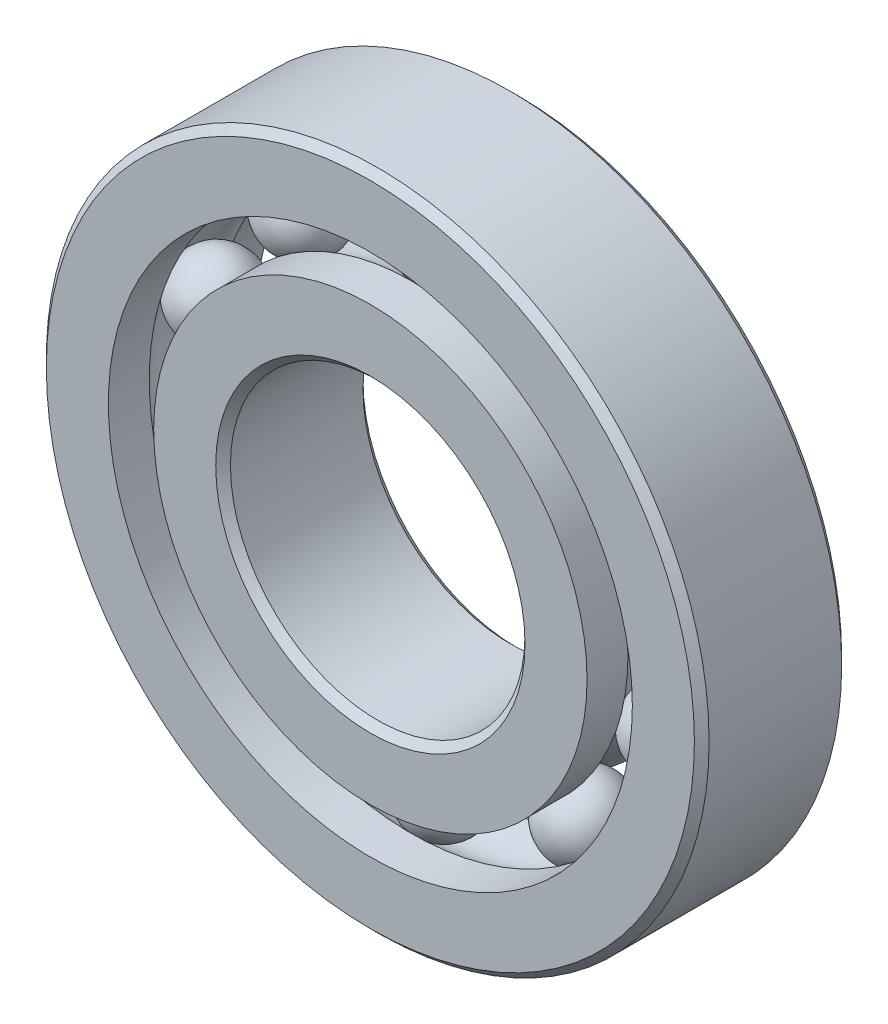
ISO-10303-21;
HEADER;
FILE_DESCRIPTION(('STEP AP214'),'2;1');
FILE_NAME('part.step','',(''),(''),'','','');
FILE_SCHEMA(('AUTOMOTIVE_DESIGN { 1 0 10303 214 1 1 1 1 }'));
ENDSEC;
DATA;
#1=APPLICATION_CONTEXT('core data for automotive mechanical design processes');
#2=APPLICATION_PROTOCOL_DEFINITION('international standard','automotive_design',2000,#1);
#3=PRODUCT_CONTEXT('',#1,'mechanical');
#4=PRODUCT('Part','Part','',(#3));
#5=PRODUCT_RELATED_PRODUCT_CATEGORY('part','',(#4));
#6=PRODUCT_DEFINITION_FORMATION('','',#4);
#7=PRODUCT_DEFINITION_CONTEXT('part definition',#1,'design');
#8=PRODUCT_DEFINITION('design','',#6,#7);
#9=PRODUCT_DEFINITION_SHAPE('','',#8);
#10=(LENGTH_UNIT() NAMED_UNIT(*) SI_UNIT(.MILLI.,.METRE.));
#11=(NAMED_UNIT(*) PLANE_ANGLE_UNIT() SI_UNIT($,.RADIAN.));
#12=(NAMED_UNIT(*) SI_UNIT($,.STERADIAN.) SOLID_ANGLE_UNIT());
#13=UNCERTAINTY_MEASURE_WITH_UNIT(LENGTH_MEASURE(1.E-05),#10,'distance_accuracy_value','');
#14=(GEOMETRIC_REPRESENTATION_CONTEXT(3) GLOBAL_UNCERTAINTY_ASSIGNED_CONTEXT((#13)) GLOBAL_UNIT_ASSIGNED_CONTEXT((#10,
#11,#12)) REPRESENTATION_CONTEXT('',''));
#15=CARTESIAN_POINT('',(0.,0.,0.));
#16=DIRECTION('',(0.,0.,1.));
#17=DIRECTION('',(1.,0.,0.));
#18=AXIS2_PLACEMENT_3D('',#15,#16,#17);
#19=CARTESIAN_POINT('',(-6.06520907209285,8.34804411070657,0.));
#20=DIRECTION('',(0.,0.,1.));
#21=DIRECTION('',(-0.587785252292462,0.809016994374955,0.));
#22=AXIS2_PLACEMENT_3D('',#19,#20,#21);
#23=SPHERICAL_SURFACE('',#22,1.71627890103156);
#24=CARTESIAN_POINT('',(-6.06520907209285,8.34804411070657,1.71627890103156));
#25=VERTEX_POINT('',#24);
#26=VERTEX_LOOP('',#25);
#27=FACE_BOUND('',#26,.T.);
#28=ADVANCED_FACE('F44',(#27),#23,.T.);
#29=CLOSED_SHELL('',(#28));
#30=MANIFOLD_SOLID_BREP('B2',#29);
#31=CARTESIAN_POINT('',(-9.81371442752058,3.1886691107066,0.));
#32=DIRECTION('',(0.,0.,1.));
#33=DIRECTION('',(-0.95105651629515,0.309016994374958,0.));
#34=AXIS2_PLACEMENT_3D('',#31,#32,#33);
#35=SPHERICAL_SURFACE('',#34,1.71627890103156);
#36=CARTESIAN_POINT('',(-9.81371442752058,3.1886691107066,1.71627890103156));
#37=VERTEX_POINT('',#36);
#38=VERTEX_LOOP('',#37);
#39=FACE_BOUND('',#38,.T.);
#40=ADVANCED_FACE('F67',(#39),#35,.T.);
#41=CLOSED_SHELL('',(#40));
#42=MANIFOLD_SOLID_BREP('B6',#41);
#43=CARTESIAN_POINT('',(-9.81371442752065,-3.18866911070639,0.));
#44=DIRECTION('',(0.,0.,1.));
#45=DIRECTION('',(-0.951056516295157,-0.309016994374938,0.));
#46=AXIS2_PLACEMENT_3D('',#43,#44,#45);
#47=SPHERICAL_SURFACE('',#46,1.71627890103156);
#48=CARTESIAN_POINT('',(-9.81371442752065,-3.18866911070639,1.71627890103156));
#49=VERTEX_POINT('',#48);
#50=VERTEX_LOOP('',#49);
#51=FACE_BOUND('',#50,.T.);
#52=ADVANCED_FACE('F90',(#51),#47,.T.);
#53=CLOSED_SHELL('',(#52));
#54=MANIFOLD_SOLID_BREP('B40',#53);
#55=CARTESIAN_POINT('',(-6.06520907209303,-8.34804411070643,0.));
#56=DIRECTION('',(0.,0.,1.));
#57=DIRECTION('',(-0.58778525229248,-0.809016994374942,0.));
#58=AXIS2_PLACEMENT_3D('',#55,#56,#57);
#59=SPHERICAL_SURFACE('',#58,1.71627890103156);
#60=CARTESIAN_POINT('',(-6.06520907209303,-8.34804411070643,1.71627890103156));
#61=VERTEX_POINT('',#60);
#62=VERTEX_LOOP('',#61);
#63=FACE_BOUND('',#62,.T.);
#64=ADVANCED_FACE('F113',(#63),#59,.T.);
#65=CLOSED_SHELL('',(#64));
#66=MANIFOLD_SOLID_BREP('B63',#65);
#67=CARTESIAN_POINT('',(0.,-10.31875,0.));
#68=DIRECTION('',(0.,0.,1.));
#69=DIRECTION('',(0.,-1.,0.));
#70=AXIS2_PLACEMENT_3D('',#67,#68,#69);
#71=SPHERICAL_SURFACE('',#70,1.71627890103156);
#72=CARTESIAN_POINT('',(0.,-10.31875,1.71627890103156));
#73=VERTEX_POINT('',#72);
#74=VERTEX_LOOP('',#73);
#75=FACE_BOUND('',#74,.T.);
#76=ADVANCED_FACE('F136',(#75),#71,.T.);
#77=CLOSED_SHELL('',(#76));
#78=MANIFOLD_SOLID_BREP('B86',#77);
#79=CARTESIAN_POINT('',(6.06520907209291,-8.34804411070652,0.));
#80=DIRECTION('',(0.,0.,1.));
#81=DIRECTION('',(0.587785252292469,-0.809016994374951,0.));
#82=AXIS2_PLACEMENT_3D('',#79,#80,#81);
#83=SPHERICAL_SURFACE('',#82,1.71627890103156);
#84=CARTESIAN_POINT('',(6.06520907209291,-8.34804411070652,1.71627890103156));
#85=VERTEX_POINT('',#84);
#86=VERTEX_LOOP('',#85);
#87=FACE_BOUND('',#86,.T.);
#88=ADVANCED_FACE('F159',(#87),#83,.T.);
#89=CLOSED_SHELL('',(#88));
#90=MANIFOLD_SOLID_BREP('B109',#89);
#91=CARTESIAN_POINT('',(9.8137144275206,-3.18866911070653,0.));
#92=DIRECTION('',(0.,0.,1.));
#93=DIRECTION('',(0.951056516295152,-0.309016994374952,0.));
#94=AXIS2_PLACEMENT_3D('',#91,#92,#93);
#95=SPHERICAL_SURFACE('',#94,1.71627890103156);
#96=CARTESIAN_POINT('',(9.8137144275206,-3.18866911070653,1.71627890103156));
#97=VERTEX_POINT('',#96);
#98=VERTEX_LOOP('',#97);
#99=FACE_BOUND('',#98,.T.);
#100=ADVANCED_FACE('F182',(#99),#95,.T.);
#101=CLOSED_SHELL('',(#100));
#102=MANIFOLD_SOLID_BREP('B132',#101);
#103=CARTESIAN_POINT('',(9.81371442752063,3.18866911070646,0.));
#104=DIRECTION('',(0.,0.,1.));
#105=DIRECTION('',(0.951056516295155,0.309016994374945,0.));
#106=AXIS2_PLACEMENT_3D('',#103,#104,#105);
#107=SPHERICAL_SURFACE('',#106,1.71627890103156);
#108=CARTESIAN_POINT('',(9.81371442752063,3.18866911070646,1.71627890103156));
#109=VERTEX_POINT('',#108);
#110=VERTEX_LOOP('',#109);
#111=FACE_BOUND('',#110,.T.);
#112=ADVANCED_FACE('F205',(#111),#107,.T.);
#113=CLOSED_SHELL('',(#112));
#114=MANIFOLD_SOLID_BREP('B155',#113);
#115=CARTESIAN_POINT('',(6.06520907209297,8.34804411070648,0.));
#116=DIRECTION('',(0.,0.,1.));
#117=DIRECTION('',(0.587785252292474,0.809016994374947,0.));
#118=AXIS2_PLACEMENT_3D('',#115,#116,#117);
#119=SPHERICAL_SURFACE('',#118,1.71627890103156);
#120=CARTESIAN_POINT('',(6.06520907209297,8.34804411070648,1.71627890103156));
#121=VERTEX_POINT('',#120);
#122=VERTEX_LOOP('',#121);
#123=FACE_BOUND('',#122,.T.);
#124=ADVANCED_FACE('F228',(#123),#119,.T.);
#125=CLOSED_SHELL('',(#124));
#126=MANIFOLD_SOLID_BREP('B178',#125);
#127=CARTESIAN_POINT('',(0.,10.31875,0.));
#128=DIRECTION('',(0.,0.,1.));
#129=DIRECTION('',(0.,1.,0.));
#130=AXIS2_PLACEMENT_3D('',#127,#128,#129);
#131=SPHERICAL_SURFACE('',#130,1.71627890103156);
#132=CARTESIAN_POINT('',(0.,10.31875,1.71627890103156));
#133=VERTEX_POINT('',#132);
#134=VERTEX_LOOP('',#133);
#135=FACE_BOUND('',#134,.T.);
#136=ADVANCED_FACE('F253',(#135),#131,.T.);
#137=CLOSED_SHELL('',(#136));
#138=MANIFOLD_SOLID_BREP('B201',#137);
#139=CARTESIAN_POINT('',(0.,9.34182692307692,3.175));
#140=DIRECTION('',(0.,0.,-1.));
#141=DIRECTION('',(-1.,0.,0.));
#142=AXIS2_PLACEMENT_3D('',#139,#140,#141);
#143=PLANE('',#142);
#144=CARTESIAN_POINT('',(0.,0.,3.175));
#145=DIRECTION('',(0.,0.,1.));
#146=DIRECTION('',(1.,0.,0.));
#147=AXIS2_PLACEMENT_3D('',#144,#145,#146);
#148=CIRCLE('',#147,6.6675);
#149=CARTESIAN_POINT('',(6.6675,0.,3.175));
#150=VERTEX_POINT('',#149);
#151=EDGE_CURVE('E303',#150,#150,#148,.T.);
#152=ORIENTED_EDGE('',*,*,#151,.F.);
#153=EDGE_LOOP('',(#152));
#154=FACE_BOUND('',#153,.T.);
#155=CARTESIAN_POINT('',(0.,0.,3.175));
#156=DIRECTION('',(0.,0.,1.));
#157=DIRECTION('',(1.,0.,0.));
#158=AXIS2_PLACEMENT_3D('',#155,#156,#157);
#159=CIRCLE('',#158,9.34182692307692);
#160=CARTESIAN_POINT('',(9.34182692307692,0.,3.175));
#161=VERTEX_POINT('',#160);
#162=EDGE_CURVE('E252',#161,#161,#159,.T.);
#163=ORIENTED_EDGE('',*,*,#162,.T.);
#164=EDGE_LOOP('',(#163));
#165=FACE_BOUND('',#164,.T.);
#166=ADVANCED_FACE('F275',(#154,#165),#143,.F.);
#167=CARTESIAN_POINT('',(0.,0.,3.175));
#168=DIRECTION('',(0.,0.,1.));
#169=DIRECTION('',(1.,0.,0.));
#170=AXIS2_PLACEMENT_3D('',#167,#168,#169);
#171=CYLINDRICAL_SURFACE('',#170,9.34182692307692);
#172=ORIENTED_EDGE('',*,*,#162,.F.);
#173=EDGE_LOOP('',(#172));
#174=FACE_BOUND('',#173,.T.);
#175=CARTESIAN_POINT('',(0.,0.,1.41111111111111));
#176=DIRECTION('',(0.,0.,1.));
#177=DIRECTION('',(1.,0.,0.));
#178=AXIS2_PLACEMENT_3D('',#175,#176,#177);
#179=CIRCLE('',#178,9.34182692307692);
#180=CARTESIAN_POINT('',(9.34182692307692,0.,1.41111111111111));
#181=VERTEX_POINT('',#180);
#182=EDGE_CURVE('E281',#181,#181,#179,.T.);
#183=ORIENTED_EDGE('',*,*,#182,.T.);
#184=EDGE_LOOP('',(#183));
#185=FACE_BOUND('',#184,.T.);
#186=ADVANCED_FACE('F310',(#174,#185),#171,.T.);
#187=CARTESIAN_POINT('',(0.,0.,0.));
#188=DIRECTION('',(0.,0.,1.));
#189=DIRECTION('',(1.,0.,0.));
#190=AXIS2_PLACEMENT_3D('',#187,#188,#189);
#191=TOROIDAL_SURFACE('',#190,10.31875,1.71627890103155);
#192=ORIENTED_EDGE('',*,*,#182,.F.);
#193=EDGE_LOOP('',(#192));
#194=FACE_BOUND('',#193,.T.);
#195=CARTESIAN_POINT('',(0.,0.,-1.41111111111111));
#196=DIRECTION('',(0.,0.,1.));
#197=DIRECTION('',(1.,0.,0.));
#198=AXIS2_PLACEMENT_3D('',#195,#196,#197);
#199=CIRCLE('',#198,9.34182692307692);
#200=CARTESIAN_POINT('',(9.34182692307692,0.,-1.41111111111111));
#201=VERTEX_POINT('',#200);
#202=EDGE_CURVE('E285',#201,#201,#199,.T.);
#203=ORIENTED_EDGE('',*,*,#202,.T.);
#204=EDGE_LOOP('',(#203));
#205=FACE_BOUND('',#204,.T.);
#206=ADVANCED_FACE('F314',(#194,#205),#191,.F.);
#207=CARTESIAN_POINT('',(0.,0.,3.175));
#208=DIRECTION('',(0.,0.,1.));
#209=DIRECTION('',(1.,0.,0.));
#210=AXIS2_PLACEMENT_3D('',#207,#208,#209);
#211=CYLINDRICAL_SURFACE('',#210,9.34182692307692);
#212=ORIENTED_EDGE('',*,*,#202,.F.);
#213=EDGE_LOOP('',(#212));
#214=FACE_BOUND('',#213,.T.);
#215=CARTESIAN_POINT('',(0.,0.,-3.175));
#216=DIRECTION('',(0.,0.,1.));
#217=DIRECTION('',(1.,0.,0.));
#218=AXIS2_PLACEMENT_3D('',#215,#216,#217);
#219=CIRCLE('',#218,9.34182692307692);
#220=CARTESIAN_POINT('',(9.34182692307692,0.,-3.175));
#221=VERTEX_POINT('',#220);
#222=EDGE_CURVE('E289',#221,#221,#219,.T.);
#223=ORIENTED_EDGE('',*,*,#222,.T.);
#224=EDGE_LOOP('',(#223));
#225=FACE_BOUND('',#224,.T.);
#226=ADVANCED_FACE('F319',(#214,#225),#211,.T.);
#227=CARTESIAN_POINT('',(0.,6.6675,-3.175));
#228=DIRECTION('',(0.,0.,1.));
#229=DIRECTION('',(1.,0.,0.));
#230=AXIS2_PLACEMENT_3D('',#227,#228,#229);
#231=PLANE('',#230);
#232=ORIENTED_EDGE('',*,*,#222,.F.);
#233=EDGE_LOOP('',(#232));
#234=FACE_BOUND('',#233,.T.);
#235=CARTESIAN_POINT('',(0.,0.,-3.175));
#236=DIRECTION('',(0.,0.,1.));
#237=DIRECTION('',(1.,0.,0.));
#238=AXIS2_PLACEMENT_3D('',#235,#236,#237);
#239=CIRCLE('',#238,6.6675);
#240=CARTESIAN_POINT('',(6.6675,0.,-3.175));
#241=VERTEX_POINT('',#240);
#242=EDGE_CURVE('E294',#241,#241,#239,.T.);
#243=ORIENTED_EDGE('',*,*,#242,.T.);
#244=EDGE_LOOP('',(#243));
#245=FACE_BOUND('',#244,.T.);
#246=ADVANCED_FACE('F325',(#234,#245),#231,.F.);
#247=CARTESIAN_POINT('',(0.,0.,-2.8575));
#248=DIRECTION('',(0.,0.,-1.));
#249=DIRECTION('',(-1.,0.,0.));
#250=AXIS2_PLACEMENT_3D('',#247,#248,#249);
#251=CONICAL_SURFACE('',#250,6.35,0.785398163397446);
#252=ORIENTED_EDGE('',*,*,#242,.F.);
#253=EDGE_LOOP('',(#252));
#254=FACE_BOUND('',#253,.T.);
#255=CARTESIAN_POINT('',(0.,0.,-2.8575));
#256=DIRECTION('',(0.,0.,1.));
#257=DIRECTION('',(1.,0.,0.));
#258=AXIS2_PLACEMENT_3D('',#255,#256,#257);
#259=CIRCLE('',#258,6.35);
#260=CARTESIAN_POINT('',(6.35,0.,-2.8575));
#261=VERTEX_POINT('',#260);
#262=EDGE_CURVE('E297',#261,#261,#259,.T.);
#263=ORIENTED_EDGE('',*,*,#262,.T.);
#264=EDGE_LOOP('',(#263));
#265=FACE_BOUND('',#264,.T.);
#266=ADVANCED_FACE('F329',(#254,#265),#251,.F.);
#267=CARTESIAN_POINT('',(0.,0.,3.175));
#268=DIRECTION('',(0.,0.,1.));
#269=DIRECTION('',(1.,0.,0.));
#270=AXIS2_PLACEMENT_3D('',#267,#268,#269);
#271=CYLINDRICAL_SURFACE('',#270,6.35);
#272=ORIENTED_EDGE('',*,*,#262,.F.);
#273=EDGE_LOOP('',(#272));
#274=FACE_BOUND('',#273,.T.);
#275=CARTESIAN_POINT('',(0.,0.,2.8575));
#276=DIRECTION('',(0.,0.,1.));
#277=DIRECTION('',(1.,0.,0.));
#278=AXIS2_PLACEMENT_3D('',#275,#276,#277);
#279=CIRCLE('',#278,6.35);
#280=CARTESIAN_POINT('',(6.35,0.,2.8575));
#281=VERTEX_POINT('',#280);
#282=EDGE_CURVE('E300',#281,#281,#279,.T.);
#283=ORIENTED_EDGE('',*,*,#282,.T.);
#284=EDGE_LOOP('',(#283));
#285=FACE_BOUND('',#284,.T.);
#286=ADVANCED_FACE('F333',(#274,#285),#271,.F.);
#287=CARTESIAN_POINT('',(0.,0.,3.175));
#288=DIRECTION('',(0.,0.,1.));
#289=DIRECTION('',(1.,0.,0.));
#290=AXIS2_PLACEMENT_3D('',#287,#288,#289);
#291=CONICAL_SURFACE('',#290,6.6675,0.785398163397452);
#292=ORIENTED_EDGE('',*,*,#282,.F.);
#293=EDGE_LOOP('',(#292));
#294=FACE_BOUND('',#293,.T.);
#295=ORIENTED_EDGE('',*,*,#151,.T.);
#296=EDGE_LOOP('',(#295));
#297=FACE_BOUND('',#296,.T.);
#298=ADVANCED_FACE('F307',(#294,#297),#291,.F.);
#299=CLOSED_SHELL('',(#166,#186,#206,#226,#246,#266,#286,#298));
#300=MANIFOLD_SOLID_BREP('B224',#299);
#301=CARTESIAN_POINT('',(0.,0.,2.8575));
#302=DIRECTION('',(0.,0.,-1.));
#303=DIRECTION('',(-1.,0.,0.));
#304=AXIS2_PLACEMENT_3D('',#301,#302,#303);
#305=CONICAL_SURFACE('',#304,14.2875,0.785398163397446);
#306=CARTESIAN_POINT('',(0.,0.,3.175));
#307=DIRECTION('',(0.,0.,1.));
#308=DIRECTION('',(1.,0.,0.));
#309=AXIS2_PLACEMENT_3D('',#306,#307,#308);
#310=CIRCLE('',#309,13.97);
#311=CARTESIAN_POINT('',(13.97,0.,3.175));
#312=VERTEX_POINT('',#311);
#313=EDGE_CURVE('E427',#312,#312,#310,.T.);
#314=ORIENTED_EDGE('',*,*,#313,.F.);
#315=EDGE_LOOP('',(#314));
#316=FACE_BOUND('',#315,.T.);
#317=CARTESIAN_POINT('',(0.,0.,2.8575));
#318=DIRECTION('',(0.,0.,1.));
#319=DIRECTION('',(1.,0.,0.));
#320=AXIS2_PLACEMENT_3D('',#317,#318,#319);
#321=CIRCLE('',#320,14.2875);
#322=CARTESIAN_POINT('',(14.2875,0.,2.8575));
#323=VERTEX_POINT('',#322);
#324=EDGE_CURVE('E274',#323,#323,#321,.T.);
#325=ORIENTED_EDGE('',*,*,#324,.T.);
#326=EDGE_LOOP('',(#325));
#327=FACE_BOUND('',#326,.T.);
#328=ADVANCED_FACE('F399',(#316,#327),#305,.T.);
#329=CARTESIAN_POINT('',(0.,0.,3.175));
#330=DIRECTION('',(0.,0.,1.));
#331=DIRECTION('',(1.,0.,0.));
#332=AXIS2_PLACEMENT_3D('',#329,#330,#331);
#333=CYLINDRICAL_SURFACE('',#332,14.2875);
#334=ORIENTED_EDGE('',*,*,#324,.F.);
#335=EDGE_LOOP('',(#334));
#336=FACE_BOUND('',#335,.T.);
#337=CARTESIAN_POINT('',(0.,0.,-2.8575));
#338=DIRECTION('',(0.,0.,1.));
#339=DIRECTION('',(1.,0.,0.));
#340=AXIS2_PLACEMENT_3D('',#337,#338,#339);
#341=CIRCLE('',#340,14.2875);
#342=CARTESIAN_POINT('',(14.2875,0.,-2.8575));
#343=VERTEX_POINT('',#342);
#344=EDGE_CURVE('E405',#343,#343,#341,.T.);
#345=ORIENTED_EDGE('',*,*,#344,.T.);
#346=EDGE_LOOP('',(#345));
#347=FACE_BOUND('',#346,.T.);
#348=ADVANCED_FACE('F434',(#336,#347),#333,.T.);
#349=CARTESIAN_POINT('',(0.,0.,-3.175));
#350=DIRECTION('',(0.,0.,1.));
#351=DIRECTION('',(1.,0.,0.));
#352=AXIS2_PLACEMENT_3D('',#349,#350,#351);
#353=CONICAL_SURFACE('',#352,13.97,0.785398163397446);
#354=ORIENTED_EDGE('',*,*,#344,.F.);
#355=EDGE_LOOP('',(#354));
#356=FACE_BOUND('',#355,.T.);
#357=CARTESIAN_POINT('',(0.,0.,-3.175));
#358=DIRECTION('',(0.,0.,1.));
#359=DIRECTION('',(1.,0.,0.));
#360=AXIS2_PLACEMENT_3D('',#357,#358,#359);
#361=CIRCLE('',#360,13.97);
#362=CARTESIAN_POINT('',(13.97,0.,-3.175));
#363=VERTEX_POINT('',#362);
#364=EDGE_CURVE('E409',#363,#363,#361,.T.);
#365=ORIENTED_EDGE('',*,*,#364,.T.);
#366=EDGE_LOOP('',(#365));
#367=FACE_BOUND('',#366,.T.);
#368=ADVANCED_FACE('F438',(#356,#367),#353,.T.);
#369=CARTESIAN_POINT('',(0.,13.97,-3.175));
#370=DIRECTION('',(0.,0.,1.));
#371=DIRECTION('',(1.,0.,0.));
#372=AXIS2_PLACEMENT_3D('',#369,#370,#371);
#373=PLANE('',#372);
#374=ORIENTED_EDGE('',*,*,#364,.F.);
#375=EDGE_LOOP('',(#374));
#376=FACE_BOUND('',#375,.T.);
#377=CARTESIAN_POINT('',(0.,0.,-3.175));
#378=DIRECTION('',(0.,0.,1.));
#379=DIRECTION('',(1.,0.,0.));
#380=AXIS2_PLACEMENT_3D('',#377,#378,#379);
#381=CIRCLE('',#380,11.2956730769231);
#382=CARTESIAN_POINT('',(11.2956730769231,0.,-3.175));
#383=VERTEX_POINT('',#382);
#384=EDGE_CURVE('E413',#383,#383,#381,.T.);
#385=ORIENTED_EDGE('',*,*,#384,.T.);
#386=EDGE_LOOP('',(#385));
#387=FACE_BOUND('',#386,.T.);
#388=ADVANCED_FACE('F443',(#376,#387),#373,.F.);
#389=CARTESIAN_POINT('',(0.,0.,3.175));
#390=DIRECTION('',(0.,0.,1.));
#391=DIRECTION('',(1.,0.,0.));
#392=AXIS2_PLACEMENT_3D('',#389,#390,#391);
#393=CYLINDRICAL_SURFACE('',#392,11.2956730769231);
#394=ORIENTED_EDGE('',*,*,#384,.F.);
#395=EDGE_LOOP('',(#394));
#396=FACE_BOUND('',#395,.T.);
#397=CARTESIAN_POINT('',(0.,0.,-1.41111111111111));
#398=DIRECTION('',(0.,0.,1.));
#399=DIRECTION('',(1.,0.,0.));
#400=AXIS2_PLACEMENT_3D('',#397,#398,#399);
#401=CIRCLE('',#400,11.2956730769231);
#402=CARTESIAN_POINT('',(11.2956730769231,0.,-1.41111111111111));
#403=VERTEX_POINT('',#402);
#404=EDGE_CURVE('E418',#403,#403,#401,.T.);
#405=ORIENTED_EDGE('',*,*,#404,.T.);
#406=EDGE_LOOP('',(#405));
#407=FACE_BOUND('',#406,.T.);
#408=ADVANCED_FACE('F449',(#396,#407),#393,.F.);
#409=CARTESIAN_POINT('',(0.,0.,0.));
#410=DIRECTION('',(0.,0.,1.));
#411=DIRECTION('',(1.,0.,0.));
#412=AXIS2_PLACEMENT_3D('',#409,#410,#411);
#413=TOROIDAL_SURFACE('',#412,10.31875,1.71627890103156);
#414=ORIENTED_EDGE('',*,*,#404,.F.);
#415=EDGE_LOOP('',(#414));
#416=FACE_BOUND('',#415,.T.);
#417=CARTESIAN_POINT('',(0.,0.,1.41111111111111));
#418=DIRECTION('',(0.,0.,1.));
#419=DIRECTION('',(1.,0.,0.));
#420=AXIS2_PLACEMENT_3D('',#417,#418,#419);
#421=CIRCLE('',#420,11.2956730769231);
#422=CARTESIAN_POINT('',(11.2956730769231,0.,1.41111111111111));
#423=VERTEX_POINT('',#422);
#424=EDGE_CURVE('E421',#423,#423,#421,.T.);
#425=ORIENTED_EDGE('',*,*,#424,.T.);
#426=EDGE_LOOP('',(#425));
#427=FACE_BOUND('',#426,.T.);
#428=ADVANCED_FACE('F453',(#416,#427),#413,.F.);
#429=CARTESIAN_POINT('',(0.,0.,3.175));
#430=DIRECTION('',(0.,0.,1.));
#431=DIRECTION('',(1.,0.,0.));
#432=AXIS2_PLACEMENT_3D('',#429,#430,#431);
#433=CYLINDRICAL_SURFACE('',#432,11.2956730769231);
#434=ORIENTED_EDGE('',*,*,#424,.F.);
#435=EDGE_LOOP('',(#434));
#436=FACE_BOUND('',#435,.T.);
#437=CARTESIAN_POINT('',(0.,0.,3.175));
#438=DIRECTION('',(0.,0.,1.));
#439=DIRECTION('',(1.,0.,0.));
#440=AXIS2_PLACEMENT_3D('',#437,#438,#439);
#441=CIRCLE('',#440,11.2956730769231);
#442=CARTESIAN_POINT('',(11.2956730769231,0.,3.175));
#443=VERTEX_POINT('',#442);
#444=EDGE_CURVE('E424',#443,#443,#441,.T.);
#445=ORIENTED_EDGE('',*,*,#444,.T.);
#446=EDGE_LOOP('',(#445));
#447=FACE_BOUND('',#446,.T.);
#448=ADVANCED_FACE('F457',(#436,#447),#433,.F.);
#449=CARTESIAN_POINT('',(0.,13.97,3.175));
#450=DIRECTION('',(0.,0.,-1.));
#451=DIRECTION('',(-1.,0.,0.));
#452=AXIS2_PLACEMENT_3D('',#449,#450,#451);
#453=PLANE('',#452);
#454=ORIENTED_EDGE('',*,*,#444,.F.);
#455=EDGE_LOOP('',(#454));
#456=FACE_BOUND('',#455,.T.);
#457=ORIENTED_EDGE('',*,*,#313,.T.);
#458=EDGE_LOOP('',(#457));
#459=FACE_BOUND('',#458,.T.);
#460=ADVANCED_FACE('F431',(#456,#459),#453,.F.);
#461=CLOSED_SHELL('',(#328,#348,#368,#388,#408,#428,#448,#460));
#462=MANIFOLD_SOLID_BREP('B247',#461);
#463=ADVANCED_BREP_SHAPE_REPRESENTATION('',(#18,#30,#42,#54,#66,#78,#90,#102,#114,#126,#138,
#300,#462),#14);
#464=SHAPE_DEFINITION_REPRESENTATION(#9,#463);
ENDSEC;
END-ISO-10303-21;
